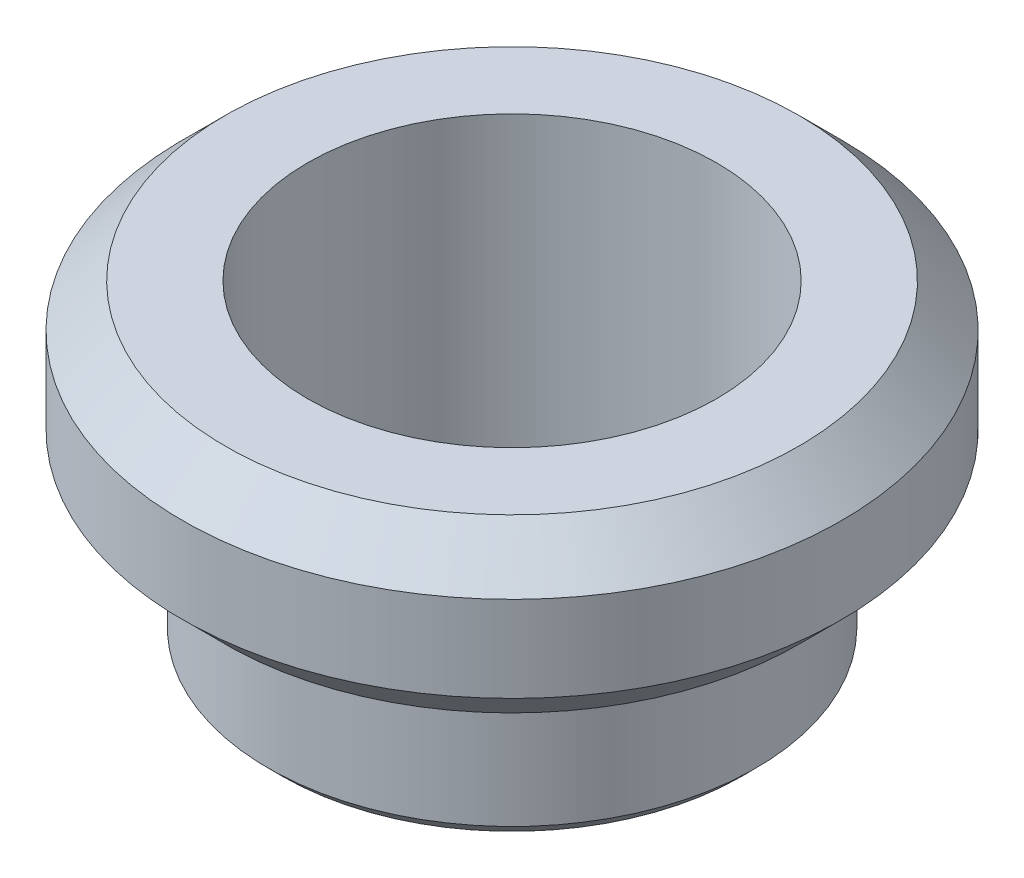
ISO-10303-21;
HEADER;
FILE_DESCRIPTION(('STEP AP214'),'2;1');
FILE_NAME('part.step','',(''),(''),'','','');
FILE_SCHEMA(('AUTOMOTIVE_DESIGN { 1 0 10303 214 1 1 1 1 }'));
ENDSEC;
DATA;
#1=APPLICATION_CONTEXT('core data for automotive mechanical design processes');
#2=APPLICATION_PROTOCOL_DEFINITION('international standard','automotive_design',2000,#1);
#3=PRODUCT_CONTEXT('',#1,'mechanical');
#4=PRODUCT('Part','Part','',(#3));
#5=PRODUCT_RELATED_PRODUCT_CATEGORY('part','',(#4));
#6=PRODUCT_DEFINITION_FORMATION('','',#4);
#7=PRODUCT_DEFINITION_CONTEXT('part definition',#1,'design');
#8=PRODUCT_DEFINITION('design','',#6,#7);
#9=PRODUCT_DEFINITION_SHAPE('','',#8);
#10=(LENGTH_UNIT() NAMED_UNIT(*) SI_UNIT(.MILLI.,.METRE.));
#11=(NAMED_UNIT(*) PLANE_ANGLE_UNIT() SI_UNIT($,.RADIAN.));
#12=(NAMED_UNIT(*) SI_UNIT($,.STERADIAN.) SOLID_ANGLE_UNIT());
#13=UNCERTAINTY_MEASURE_WITH_UNIT(LENGTH_MEASURE(1.E-05),#10,'distance_accuracy_value','');
#14=(GEOMETRIC_REPRESENTATION_CONTEXT(3) GLOBAL_UNCERTAINTY_ASSIGNED_CONTEXT((#13)) GLOBAL_UNIT_ASSIGNED_CONTEXT((#10,
#11,#12)) REPRESENTATION_CONTEXT('',''));
#15=CARTESIAN_POINT('',(0.,0.,0.));
#16=DIRECTION('',(0.,0.,1.));
#17=DIRECTION('',(1.,0.,0.));
#18=AXIS2_PLACEMENT_3D('',#15,#16,#17);
#19=CARTESIAN_POINT('',(0.,0.,0.));
#20=DIRECTION('',(0.,-1.,0.));
#21=DIRECTION('',(0.,0.,-1.));
#22=AXIS2_PLACEMENT_3D('',#19,#20,#21);
#23=PLANE('',#22);
#24=CARTESIAN_POINT('',(0.,0.,0.));
#25=DIRECTION('',(0.,-1.,0.));
#26=DIRECTION('',(0.,0.,-1.));
#27=AXIS2_PLACEMENT_3D('',#24,#25,#26);
#28=CIRCLE('',#27,20.05);
#29=CARTESIAN_POINT('',(0.,0.,-20.05));
#30=VERTEX_POINT('',#29);
#31=EDGE_CURVE('E53',#30,#30,#28,.T.);
#32=ORIENTED_EDGE('',*,*,#31,.T.);
#33=EDGE_LOOP('',(#32));
#34=FACE_BOUND('',#33,.T.);
#35=CARTESIAN_POINT('',(0.,0.,0.));
#36=DIRECTION('',(0.,-1.,0.));
#37=DIRECTION('',(0.,0.,-1.));
#38=AXIS2_PLACEMENT_3D('',#35,#36,#37);
#39=CIRCLE('',#38,17.05);
#40=CARTESIAN_POINT('',(0.,0.,-17.05));
#41=VERTEX_POINT('',#40);
#42=EDGE_CURVE('E74',#41,#41,#39,.T.);
#43=ORIENTED_EDGE('',*,*,#42,.F.);
#44=EDGE_LOOP('',(#43));
#45=FACE_BOUND('',#44,.T.);
#46=ADVANCED_FACE('F41',(#34,#45),#23,.T.);
#47=CARTESIAN_POINT('',(0.,-11.25,0.));
#48=DIRECTION('',(0.,-1.,0.));
#49=DIRECTION('',(0.,0.,-1.));
#50=AXIS2_PLACEMENT_3D('',#47,#48,#49);
#51=CYLINDRICAL_SURFACE('',#50,23.05);
#52=CARTESIAN_POINT('',(0.,8.99999999999999,0.));
#53=DIRECTION('',(0.,-1.,0.));
#54=DIRECTION('',(0.,0.,-1.));
#55=AXIS2_PLACEMENT_3D('',#52,#53,#54);
#56=CIRCLE('',#55,23.05);
#57=CARTESIAN_POINT('',(0.,8.99999999999999,-23.05));
#58=VERTEX_POINT('',#57);
#59=EDGE_CURVE('E62',#58,#58,#56,.T.);
#60=ORIENTED_EDGE('',*,*,#59,.T.);
#61=EDGE_LOOP('',(#60));
#62=FACE_BOUND('',#61,.T.);
#63=CARTESIAN_POINT('',(0.,3.00000000000001,0.));
#64=DIRECTION('',(0.,-1.,0.));
#65=DIRECTION('',(0.,0.,-1.));
#66=AXIS2_PLACEMENT_3D('',#63,#64,#65);
#67=CIRCLE('',#66,23.05);
#68=CARTESIAN_POINT('',(0.,3.00000000000001,-23.05));
#69=VERTEX_POINT('',#68);
#70=EDGE_CURVE('E65',#69,#69,#67,.F.);
#71=ORIENTED_EDGE('',*,*,#70,.T.);
#72=EDGE_LOOP('',(#71));
#73=FACE_BOUND('',#72,.T.);
#74=ADVANCED_FACE('F81',(#62,#73),#51,.T.);
#75=CARTESIAN_POINT('',(0.,12.,0.));
#76=DIRECTION('',(0.,-1.,0.));
#77=DIRECTION('',(0.,0.,-1.));
#78=AXIS2_PLACEMENT_3D('',#75,#76,#77);
#79=PLANE('',#78);
#80=CARTESIAN_POINT('',(0.,12.,0.));
#81=DIRECTION('',(0.,-1.,0.));
#82=DIRECTION('',(0.,0.,-1.));
#83=AXIS2_PLACEMENT_3D('',#80,#81,#82);
#84=CIRCLE('',#83,20.05);
#85=CARTESIAN_POINT('',(0.,12.,-20.05));
#86=VERTEX_POINT('',#85);
#87=EDGE_CURVE('E57',#86,#86,#84,.F.);
#88=ORIENTED_EDGE('',*,*,#87,.T.);
#89=EDGE_LOOP('',(#88));
#90=FACE_BOUND('',#89,.T.);
#91=CARTESIAN_POINT('',(0.,12.,0.));
#92=DIRECTION('',(0.,-1.,0.));
#93=DIRECTION('',(0.,0.,-1.));
#94=AXIS2_PLACEMENT_3D('',#91,#92,#93);
#95=CIRCLE('',#94,14.3);
#96=CARTESIAN_POINT('',(0.,12.,-14.3));
#97=VERTEX_POINT('',#96);
#98=EDGE_CURVE('E68',#97,#97,#95,.T.);
#99=ORIENTED_EDGE('',*,*,#98,.T.);
#100=EDGE_LOOP('',(#99));
#101=FACE_BOUND('',#100,.T.);
#102=ADVANCED_FACE('F88',(#90,#101),#79,.F.);
#103=CARTESIAN_POINT('',(0.,-11.25,0.));
#104=DIRECTION('',(0.,-1.,0.));
#105=DIRECTION('',(0.,0.,-1.));
#106=AXIS2_PLACEMENT_3D('',#103,#104,#105);
#107=CYLINDRICAL_SURFACE('',#106,14.3);
#108=ORIENTED_EDGE('',*,*,#98,.F.);
#109=EDGE_LOOP('',(#108));
#110=FACE_BOUND('',#109,.T.);
#111=CARTESIAN_POINT('',(0.,-10.,0.));
#112=DIRECTION('',(0.,-1.,0.));
#113=DIRECTION('',(0.,0.,-1.));
#114=AXIS2_PLACEMENT_3D('',#111,#112,#113);
#115=CIRCLE('',#114,14.3);
#116=CARTESIAN_POINT('',(0.,-10.,-14.3));
#117=VERTEX_POINT('',#116);
#118=EDGE_CURVE('E71',#117,#117,#115,.T.);
#119=ORIENTED_EDGE('',*,*,#118,.T.);
#120=EDGE_LOOP('',(#119));
#121=FACE_BOUND('',#120,.T.);
#122=ADVANCED_FACE('F131',(#110,#121),#107,.F.);
#123=CARTESIAN_POINT('',(0.,-10.,0.));
#124=DIRECTION('',(0.,-1.,0.));
#125=DIRECTION('',(0.,0.,-1.));
#126=AXIS2_PLACEMENT_3D('',#123,#124,#125);
#127=PLANE('',#126);
#128=CARTESIAN_POINT('',(0.,-10.,0.));
#129=DIRECTION('',(0.,-1.,0.));
#130=DIRECTION('',(0.,0.,-1.));
#131=AXIS2_PLACEMENT_3D('',#128,#129,#130);
#132=CIRCLE('',#131,16.05);
#133=CARTESIAN_POINT('',(0.,-10.,-16.05));
#134=VERTEX_POINT('',#133);
#135=EDGE_CURVE('E49',#134,#134,#132,.T.);
#136=ORIENTED_EDGE('',*,*,#135,.T.);
#137=EDGE_LOOP('',(#136));
#138=FACE_BOUND('',#137,.T.);
#139=ORIENTED_EDGE('',*,*,#118,.F.);
#140=EDGE_LOOP('',(#139));
#141=FACE_BOUND('',#140,.T.);
#142=ADVANCED_FACE('F123',(#138,#141),#127,.T.);
#143=CARTESIAN_POINT('',(0.,-11.25,0.));
#144=DIRECTION('',(0.,-1.,0.));
#145=DIRECTION('',(0.,0.,-1.));
#146=AXIS2_PLACEMENT_3D('',#143,#144,#145);
#147=CYLINDRICAL_SURFACE('',#146,17.05);
#148=CARTESIAN_POINT('',(0.,-8.99999999999999,0.));
#149=DIRECTION('',(0.,-1.,0.));
#150=DIRECTION('',(0.,0.,-1.));
#151=AXIS2_PLACEMENT_3D('',#148,#149,#150);
#152=CIRCLE('',#151,17.05);
#153=CARTESIAN_POINT('',(0.,-8.99999999999999,-17.05));
#154=VERTEX_POINT('',#153);
#155=EDGE_CURVE('E10',#154,#154,#152,.F.);
#156=ORIENTED_EDGE('',*,*,#155,.T.);
#157=EDGE_LOOP('',(#156));
#158=FACE_BOUND('',#157,.T.);
#159=ORIENTED_EDGE('',*,*,#42,.T.);
#160=EDGE_LOOP('',(#159));
#161=FACE_BOUND('',#160,.T.);
#162=ADVANCED_FACE('F78',(#158,#161),#147,.T.);
#163=CARTESIAN_POINT('',(0.,8.99999999999999,0.));
#164=DIRECTION('',(0.,-1.,0.));
#165=DIRECTION('',(0.,0.,-1.));
#166=AXIS2_PLACEMENT_3D('',#163,#164,#165);
#167=CONICAL_SURFACE('',#166,23.05,0.78539816339745);
#168=ORIENTED_EDGE('',*,*,#87,.F.);
#169=EDGE_LOOP('',(#168));
#170=FACE_BOUND('',#169,.T.);
#171=ORIENTED_EDGE('',*,*,#59,.F.);
#172=EDGE_LOOP('',(#171));
#173=FACE_BOUND('',#172,.T.);
#174=ADVANCED_FACE('F94',(#170,#173),#167,.T.);
#175=CARTESIAN_POINT('',(0.,0.,0.));
#176=DIRECTION('',(0.,1.,0.));
#177=DIRECTION('',(0.,0.,1.));
#178=AXIS2_PLACEMENT_3D('',#175,#176,#177);
#179=CONICAL_SURFACE('',#178,20.05,0.785398163397444);
#180=ORIENTED_EDGE('',*,*,#70,.F.);
#181=EDGE_LOOP('',(#180));
#182=FACE_BOUND('',#181,.T.);
#183=ORIENTED_EDGE('',*,*,#31,.F.);
#184=EDGE_LOOP('',(#183));
#185=FACE_BOUND('',#184,.T.);
#186=ADVANCED_FACE('F99',(#182,#185),#179,.T.);
#187=CARTESIAN_POINT('',(0.,-10.,0.));
#188=DIRECTION('',(0.,1.,0.));
#189=DIRECTION('',(0.,0.,1.));
#190=AXIS2_PLACEMENT_3D('',#187,#188,#189);
#191=CONICAL_SURFACE('',#190,16.05,0.785398163397443);
#192=ORIENTED_EDGE('',*,*,#155,.F.);
#193=EDGE_LOOP('',(#192));
#194=FACE_BOUND('',#193,.T.);
#195=ORIENTED_EDGE('',*,*,#135,.F.);
#196=EDGE_LOOP('',(#195));
#197=FACE_BOUND('',#196,.T.);
#198=ADVANCED_FACE('F44',(#194,#197),#191,.T.);
#199=CLOSED_SHELL('',(#46,#74,#102,#122,#142,#162,#174,#186,#198));
#200=MANIFOLD_SOLID_BREP('B2',#199);
#201=ADVANCED_BREP_SHAPE_REPRESENTATION('',(#18,#200),#14);
#202=SHAPE_DEFINITION_REPRESENTATION(#9,#201);
ENDSEC;
END-ISO-10303-21;
